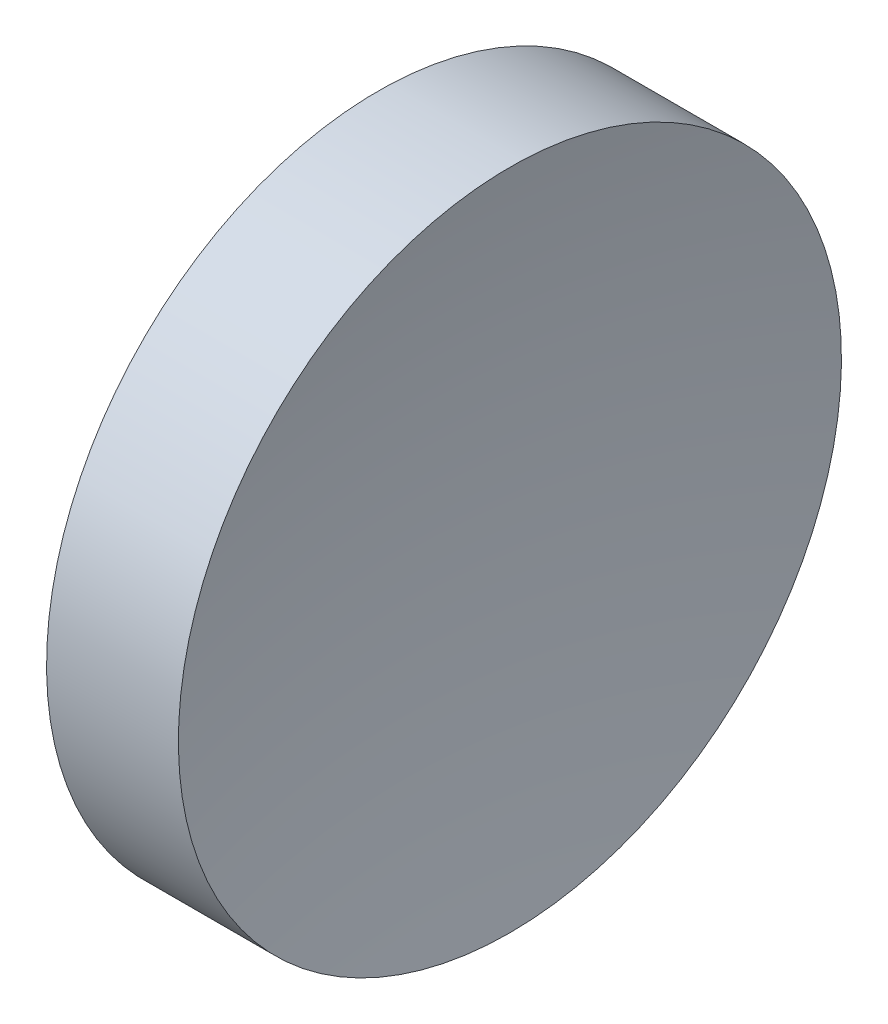
ISO-10303-21;
HEADER;
FILE_DESCRIPTION(('STEP AP214'),'2;1');
FILE_NAME('part.step','',(''),(''),'','','');
FILE_SCHEMA(('AUTOMOTIVE_DESIGN { 1 0 10303 214 1 1 1 1 }'));
ENDSEC;
DATA;
#1=APPLICATION_CONTEXT('core data for automotive mechanical design processes');
#2=APPLICATION_PROTOCOL_DEFINITION('international standard','automotive_design',2000,#1);
#3=PRODUCT_CONTEXT('',#1,'mechanical');
#4=PRODUCT('Part','Part','',(#3));
#5=PRODUCT_RELATED_PRODUCT_CATEGORY('part','',(#4));
#6=PRODUCT_DEFINITION_FORMATION('','',#4);
#7=PRODUCT_DEFINITION_CONTEXT('part definition',#1,'design');
#8=PRODUCT_DEFINITION('design','',#6,#7);
#9=PRODUCT_DEFINITION_SHAPE('','',#8);
#10=(LENGTH_UNIT() NAMED_UNIT(*) SI_UNIT(.MILLI.,.METRE.));
#11=(NAMED_UNIT(*) PLANE_ANGLE_UNIT() SI_UNIT($,.RADIAN.));
#12=(NAMED_UNIT(*) SI_UNIT($,.STERADIAN.) SOLID_ANGLE_UNIT());
#13=UNCERTAINTY_MEASURE_WITH_UNIT(LENGTH_MEASURE(1.E-05),#10,'distance_accuracy_value','');
#14=(GEOMETRIC_REPRESENTATION_CONTEXT(3) GLOBAL_UNCERTAINTY_ASSIGNED_CONTEXT((#13)) GLOBAL_UNIT_ASSIGNED_CONTEXT((#10,
#11,#12)) REPRESENTATION_CONTEXT('',''));
#15=CARTESIAN_POINT('',(0.,0.,0.));
#16=DIRECTION('',(0.,0.,1.));
#17=DIRECTION('',(1.,0.,0.));
#18=AXIS2_PLACEMENT_3D('',#15,#16,#17);
#19=CARTESIAN_POINT('',(49.7642320536207,13.031126091403,0.));
#20=DIRECTION('',(-1.,0.,0.));
#21=DIRECTION('',(0.,-1.,0.));
#22=AXIS2_PLACEMENT_3D('',#19,#20,#21);
#23=SPHERICAL_SURFACE('',#22,25.84);
#24=CARTESIAN_POINT('',(24.4125930533509,13.031126091403,0.));
#25=DIRECTION('',(-1.,0.,0.));
#26=DIRECTION('',(0.,-1.,0.));
#27=AXIS2_PLACEMENT_3D('',#24,#25,#26);
#28=CIRCLE('',#27,5.);
#29=CARTESIAN_POINT('',(24.4125930533509,8.03112609140304,0.));
#30=VERTEX_POINT('',#29);
#31=EDGE_CURVE('E10',#30,#30,#28,.T.);
#32=ORIENTED_EDGE('',*,*,#31,.F.);
#33=EDGE_LOOP('',(#32));
#34=FACE_BOUND('',#33,.T.);
#35=ADVANCED_FACE('F35',(#34),#23,.F.);
#36=CARTESIAN_POINT('',(21.5059751180825,13.031126091403,0.));
#37=DIRECTION('',(-1.,0.,0.));
#38=DIRECTION('',(0.,-1.,0.));
#39=AXIS2_PLACEMENT_3D('',#36,#37,#38);
#40=CYLINDRICAL_SURFACE('',#39,5.);
#41=CARTESIAN_POINT('',(22.4242320536207,13.031126091403,0.));
#42=DIRECTION('',(-1.,0.,0.));
#43=DIRECTION('',(0.,-1.,0.));
#44=AXIS2_PLACEMENT_3D('',#41,#42,#43);
#45=CIRCLE('',#44,5.);
#46=CARTESIAN_POINT('',(22.4242320536207,8.03112609140304,0.));
#47=VERTEX_POINT('',#46);
#48=EDGE_CURVE('E41',#47,#47,#45,.T.);
#49=ORIENTED_EDGE('',*,*,#48,.F.);
#50=EDGE_LOOP('',(#49));
#51=FACE_BOUND('',#50,.T.);
#52=ORIENTED_EDGE('',*,*,#31,.T.);
#53=EDGE_LOOP('',(#52));
#54=FACE_BOUND('',#53,.T.);
#55=ADVANCED_FACE('F49',(#51,#54),#40,.T.);
#56=CARTESIAN_POINT('',(22.4242320536207,13.031126091403,0.));
#57=DIRECTION('',(1.,0.,0.));
#58=DIRECTION('',(0.,1.,0.));
#59=AXIS2_PLACEMENT_3D('',#56,#57,#58);
#60=PLANE('',#59);
#61=ORIENTED_EDGE('',*,*,#48,.T.);
#62=EDGE_LOOP('',(#61));
#63=FACE_BOUND('',#62,.T.);
#64=ADVANCED_FACE('F47',(#63),#60,.F.);
#65=CLOSED_SHELL('',(#35,#55,#64));
#66=MANIFOLD_SOLID_BREP('B2',#65);
#67=ADVANCED_BREP_SHAPE_REPRESENTATION('',(#18,#66),#14);
#68=SHAPE_DEFINITION_REPRESENTATION(#9,#67);
ENDSEC;
END-ISO-10303-21;
